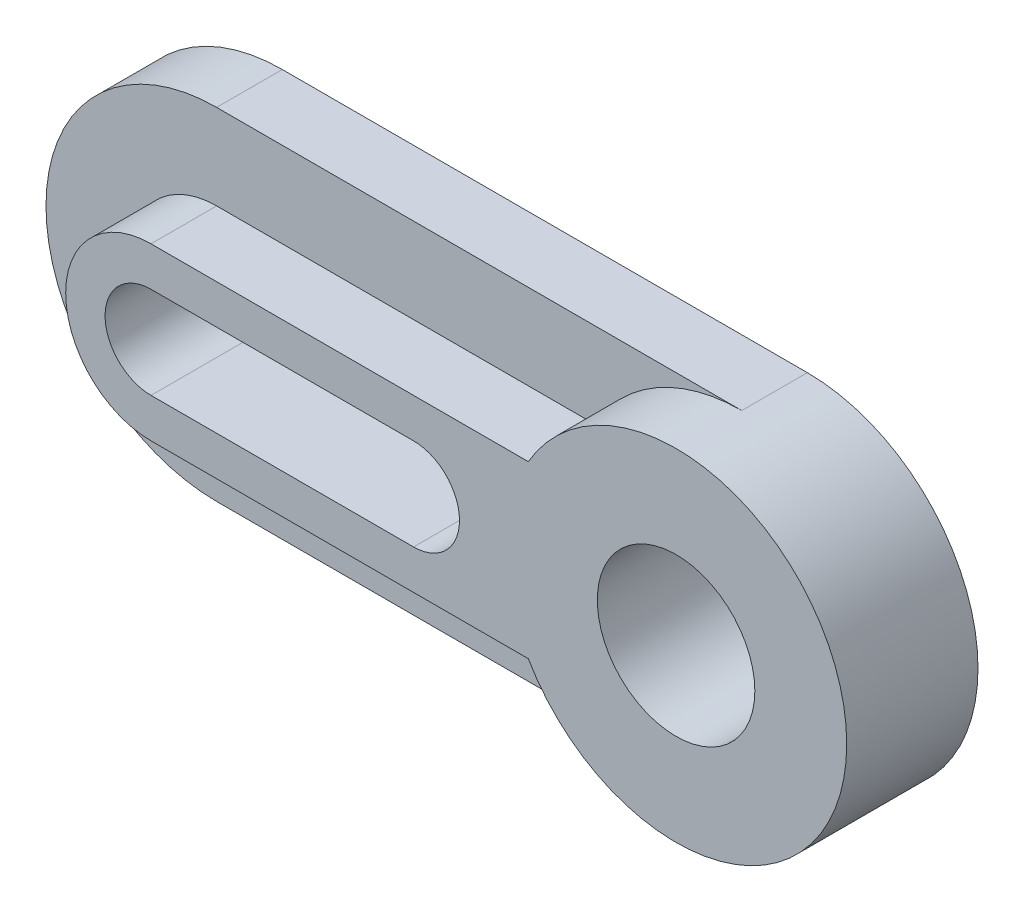
ISO-10303-21;
HEADER;
FILE_DESCRIPTION(('STEP AP214'),'2;1');
FILE_NAME('part.step','',(''),(''),'','','');
FILE_SCHEMA(('AUTOMOTIVE_DESIGN { 1 0 10303 214 1 1 1 1 }'));
ENDSEC;
DATA;
#1=APPLICATION_CONTEXT('core data for automotive mechanical design processes');
#2=APPLICATION_PROTOCOL_DEFINITION('international standard','automotive_design',2000,#1);
#3=PRODUCT_CONTEXT('',#1,'mechanical');
#4=PRODUCT('Part','Part','',(#3));
#5=PRODUCT_RELATED_PRODUCT_CATEGORY('part','',(#4));
#6=PRODUCT_DEFINITION_FORMATION('','',#4);
#7=PRODUCT_DEFINITION_CONTEXT('part definition',#1,'design');
#8=PRODUCT_DEFINITION('design','',#6,#7);
#9=PRODUCT_DEFINITION_SHAPE('','',#8);
#10=(LENGTH_UNIT() NAMED_UNIT(*) SI_UNIT(.MILLI.,.METRE.));
#11=(NAMED_UNIT(*) PLANE_ANGLE_UNIT() SI_UNIT($,.RADIAN.));
#12=(NAMED_UNIT(*) SI_UNIT($,.STERADIAN.) SOLID_ANGLE_UNIT());
#13=UNCERTAINTY_MEASURE_WITH_UNIT(LENGTH_MEASURE(1.E-05),#10,'distance_accuracy_value','');
#14=(GEOMETRIC_REPRESENTATION_CONTEXT(3) GLOBAL_UNCERTAINTY_ASSIGNED_CONTEXT((#13)) GLOBAL_UNIT_ASSIGNED_CONTEXT((#10,
#11,#12)) REPRESENTATION_CONTEXT('',''));
#15=CARTESIAN_POINT('',(0.,0.,0.));
#16=DIRECTION('',(0.,0.,1.));
#17=DIRECTION('',(1.,0.,0.));
#18=AXIS2_PLACEMENT_3D('',#15,#16,#17);
#19=CARTESIAN_POINT('',(0.,0.,10.));
#20=DIRECTION('',(0.,0.,-1.));
#21=DIRECTION('',(-1.,0.,0.));
#22=AXIS2_PLACEMENT_3D('',#19,#20,#21);
#23=CYLINDRICAL_SURFACE('',#22,26.);
#24=CARTESIAN_POINT('',(0.,0.,0.));
#25=DIRECTION('',(0.,0.,1.));
#26=DIRECTION('',(1.,0.,0.));
#27=AXIS2_PLACEMENT_3D('',#24,#25,#26);
#28=CIRCLE('',#27,26.);
#29=CARTESIAN_POINT('',(0.,26.,0.));
#30=VERTEX_POINT('',#29);
#31=CARTESIAN_POINT('',(0.,-26.,0.));
#32=VERTEX_POINT('',#31);
#33=EDGE_CURVE('E150',#30,#32,#28,.T.);
#34=ORIENTED_EDGE('',*,*,#33,.T.);
#35=DIRECTION('',(0.,0.,-1.));
#36=VECTOR('',#35,1.);
#37=CARTESIAN_POINT('',(0.,-26.,10.));
#38=LINE('',#37,#36);
#39=CARTESIAN_POINT('',(0.,-26.,10.));
#40=VERTEX_POINT('',#39);
#41=EDGE_CURVE('E45',#40,#32,#38,.T.);
#42=ORIENTED_EDGE('',*,*,#41,.F.);
#43=CARTESIAN_POINT('',(0.,0.,10.));
#44=DIRECTION('',(0.,0.,1.));
#45=DIRECTION('',(1.,0.,0.));
#46=AXIS2_PLACEMENT_3D('',#43,#44,#45);
#47=CIRCLE('',#46,26.);
#48=CARTESIAN_POINT('',(0.,26.,10.));
#49=VERTEX_POINT('',#48);
#50=EDGE_CURVE('E154',#49,#40,#47,.T.);
#51=ORIENTED_EDGE('',*,*,#50,.F.);
#52=DIRECTION('',(0.,0.,-1.));
#53=VECTOR('',#52,1.);
#54=CARTESIAN_POINT('',(0.,26.,10.));
#55=LINE('',#54,#53);
#56=EDGE_CURVE('E163',#49,#30,#55,.T.);
#57=ORIENTED_EDGE('',*,*,#56,.T.);
#58=EDGE_LOOP('',(#34,#42,#51,#57));
#59=FACE_BOUND('',#58,.T.);
#60=ADVANCED_FACE('F36',(#59),#23,.T.);
#61=CARTESIAN_POINT('',(0.,-26.,10.));
#62=DIRECTION('',(0.,1.,0.));
#63=DIRECTION('',(0.,0.,1.));
#64=AXIS2_PLACEMENT_3D('',#61,#62,#63);
#65=PLANE('',#64);
#66=DIRECTION('',(1.,0.,0.));
#67=VECTOR('',#66,1.);
#68=CARTESIAN_POINT('',(0.,-26.,0.));
#69=LINE('',#68,#67);
#70=CARTESIAN_POINT('',(80.,-26.,0.));
#71=VERTEX_POINT('',#70);
#72=EDGE_CURVE('E281',#32,#71,#69,.T.);
#73=ORIENTED_EDGE('',*,*,#72,.T.);
#74=DIRECTION('',(0.,0.,-1.));
#75=VECTOR('',#74,1.);
#76=CARTESIAN_POINT('',(80.,-26.,10.));
#77=LINE('',#76,#75);
#78=CARTESIAN_POINT('',(80.,-26.,10.));
#79=VERTEX_POINT('',#78);
#80=EDGE_CURVE('E162',#79,#71,#77,.T.);
#81=ORIENTED_EDGE('',*,*,#80,.F.);
#82=DIRECTION('',(1.,0.,0.));
#83=VECTOR('',#82,1.);
#84=CARTESIAN_POINT('',(0.,-26.,10.));
#85=LINE('',#84,#83);
#86=EDGE_CURVE('E168',#40,#79,#85,.T.);
#87=ORIENTED_EDGE('',*,*,#86,.F.);
#88=ORIENTED_EDGE('',*,*,#41,.T.);
#89=EDGE_LOOP('',(#73,#81,#87,#88));
#90=FACE_BOUND('',#89,.T.);
#91=ADVANCED_FACE('F267',(#90),#65,.F.);
#92=CARTESIAN_POINT('',(80.,0.,10.));
#93=DIRECTION('',(0.,0.,-1.));
#94=DIRECTION('',(-1.,0.,0.));
#95=AXIS2_PLACEMENT_3D('',#92,#93,#94);
#96=CYLINDRICAL_SURFACE('',#95,26.);
#97=CARTESIAN_POINT('',(80.,0.,0.));
#98=DIRECTION('',(0.,0.,1.));
#99=DIRECTION('',(1.,0.,0.));
#100=AXIS2_PLACEMENT_3D('',#97,#98,#99);
#101=CIRCLE('',#100,26.);
#102=CARTESIAN_POINT('',(80.,26.,0.));
#103=VERTEX_POINT('',#102);
#104=EDGE_CURVE('E282',#71,#103,#101,.T.);
#105=ORIENTED_EDGE('',*,*,#104,.T.);
#106=DIRECTION('',(0.,0.,-1.));
#107=VECTOR('',#106,1.);
#108=CARTESIAN_POINT('',(80.,26.,10.));
#109=LINE('',#108,#107);
#110=CARTESIAN_POINT('',(80.,26.,10.));
#111=VERTEX_POINT('',#110);
#112=EDGE_CURVE('E135',#111,#103,#109,.T.);
#113=ORIENTED_EDGE('',*,*,#112,.F.);
#114=CARTESIAN_POINT('',(80.,0.,10.));
#115=DIRECTION('',(0.,0.,1.));
#116=DIRECTION('',(1.,0.,0.));
#117=AXIS2_PLACEMENT_3D('',#114,#115,#116);
#118=CIRCLE('',#117,26.);
#119=CARTESIAN_POINT('',(57.4833395016046,13.,10.));
#120=VERTEX_POINT('',#119);
#121=EDGE_CURVE('E11',#111,#120,#118,.T.);
#122=ORIENTED_EDGE('',*,*,#121,.T.);
#123=DIRECTION('',(0.,0.,-1.));
#124=VECTOR('',#123,1.);
#125=CARTESIAN_POINT('',(57.4833395016046,13.,20.));
#126=LINE('',#125,#124);
#127=CARTESIAN_POINT('',(57.4833395016046,13.,20.));
#128=VERTEX_POINT('',#127);
#129=EDGE_CURVE('E132',#128,#120,#126,.T.);
#130=ORIENTED_EDGE('',*,*,#129,.F.);
#131=CARTESIAN_POINT('',(80.,0.,20.));
#132=DIRECTION('',(0.,0.,1.));
#133=DIRECTION('',(1.,0.,0.));
#134=AXIS2_PLACEMENT_3D('',#131,#132,#133);
#135=CIRCLE('',#134,26.);
#136=CARTESIAN_POINT('',(57.4833395016046,-13.,20.));
#137=VERTEX_POINT('',#136);
#138=EDGE_CURVE('E191',#137,#128,#135,.T.);
#139=ORIENTED_EDGE('',*,*,#138,.F.);
#140=DIRECTION('',(0.,0.,-1.));
#141=VECTOR('',#140,1.);
#142=CARTESIAN_POINT('',(57.4833395016046,-13.,20.));
#143=LINE('',#142,#141);
#144=CARTESIAN_POINT('',(57.4833395016046,-13.,10.));
#145=VERTEX_POINT('',#144);
#146=EDGE_CURVE('E140',#137,#145,#143,.T.);
#147=ORIENTED_EDGE('',*,*,#146,.T.);
#148=EDGE_CURVE('E78',#145,#79,#118,.T.);
#149=ORIENTED_EDGE('',*,*,#148,.T.);
#150=ORIENTED_EDGE('',*,*,#80,.T.);
#151=EDGE_LOOP('',(#105,#113,#122,#130,#139,#147,#149,#150));
#152=FACE_BOUND('',#151,.T.);
#153=ADVANCED_FACE('F129',(#152),#96,.T.);
#154=CARTESIAN_POINT('',(0.,26.,10.));
#155=DIRECTION('',(0.,-1.,0.));
#156=DIRECTION('',(0.,0.,-1.));
#157=AXIS2_PLACEMENT_3D('',#154,#155,#156);
#158=PLANE('',#157);
#159=DIRECTION('',(-1.,0.,0.));
#160=VECTOR('',#159,1.);
#161=CARTESIAN_POINT('',(0.,26.,0.));
#162=LINE('',#161,#160);
#163=EDGE_CURVE('E286',#103,#30,#162,.T.);
#164=ORIENTED_EDGE('',*,*,#163,.T.);
#165=ORIENTED_EDGE('',*,*,#56,.F.);
#166=DIRECTION('',(-1.,0.,0.));
#167=VECTOR('',#166,1.);
#168=CARTESIAN_POINT('',(0.,26.,10.));
#169=LINE('',#168,#167);
#170=EDGE_CURVE('E166',#111,#49,#169,.T.);
#171=ORIENTED_EDGE('',*,*,#170,.F.);
#172=ORIENTED_EDGE('',*,*,#112,.T.);
#173=EDGE_LOOP('',(#164,#165,#171,#172));
#174=FACE_BOUND('',#173,.T.);
#175=ADVANCED_FACE('F290',(#174),#158,.F.);
#176=CARTESIAN_POINT('',(0.,0.,10.));
#177=DIRECTION('',(0.,0.,1.));
#178=DIRECTION('',(1.,0.,0.));
#179=AXIS2_PLACEMENT_3D('',#176,#177,#178);
#180=PLANE('',#179);
#181=ORIENTED_EDGE('',*,*,#121,.F.);
#182=ORIENTED_EDGE('',*,*,#170,.T.);
#183=ORIENTED_EDGE('',*,*,#50,.T.);
#184=ORIENTED_EDGE('',*,*,#86,.T.);
#185=ORIENTED_EDGE('',*,*,#148,.F.);
#186=DIRECTION('',(1.,0.,0.));
#187=VECTOR('',#186,1.);
#188=CARTESIAN_POINT('',(0.,-13.,10.));
#189=LINE('',#188,#187);
#190=CARTESIAN_POINT('',(0.,-13.,10.));
#191=VERTEX_POINT('',#190);
#192=EDGE_CURVE('E153',#191,#145,#189,.T.);
#193=ORIENTED_EDGE('',*,*,#192,.F.);
#194=CARTESIAN_POINT('',(0.,0.,10.));
#195=DIRECTION('',(0.,0.,1.));
#196=DIRECTION('',(1.,0.,0.));
#197=AXIS2_PLACEMENT_3D('',#194,#195,#196);
#198=CIRCLE('',#197,13.);
#199=CARTESIAN_POINT('',(0.,13.,10.));
#200=VERTEX_POINT('',#199);
#201=EDGE_CURVE('E120',#200,#191,#198,.T.);
#202=ORIENTED_EDGE('',*,*,#201,.F.);
#203=DIRECTION('',(-1.,0.,0.));
#204=VECTOR('',#203,1.);
#205=CARTESIAN_POINT('',(0.,13.,10.));
#206=LINE('',#205,#204);
#207=EDGE_CURVE('E116',#120,#200,#206,.T.);
#208=ORIENTED_EDGE('',*,*,#207,.F.);
#209=EDGE_LOOP('',(#181,#182,#183,#184,#185,#193,#202,#208));
#210=FACE_BOUND('',#209,.T.);
#211=ADVANCED_FACE('F117',(#210),#180,.T.);
#212=CARTESIAN_POINT('',(0.,0.,0.));
#213=DIRECTION('',(0.,0.,1.));
#214=DIRECTION('',(1.,0.,0.));
#215=AXIS2_PLACEMENT_3D('',#212,#213,#214);
#216=PLANE('',#215);
#217=CARTESIAN_POINT('',(80.,0.,0.));
#218=DIRECTION('',(0.,0.,1.));
#219=DIRECTION('',(1.,0.,0.));
#220=AXIS2_PLACEMENT_3D('',#217,#218,#219);
#221=CIRCLE('',#220,12.);
#222=CARTESIAN_POINT('',(92.,0.,0.));
#223=VERTEX_POINT('',#222);
#224=EDGE_CURVE('E218',#223,#223,#221,.T.);
#225=ORIENTED_EDGE('',*,*,#224,.T.);
#226=EDGE_LOOP('',(#225));
#227=FACE_BOUND('',#226,.T.);
#228=DIRECTION('',(1.,0.,0.));
#229=VECTOR('',#228,1.);
#230=CARTESIAN_POINT('',(0.,7.,0.));
#231=LINE('',#230,#229);
#232=CARTESIAN_POINT('',(40.,7.,0.));
#233=VERTEX_POINT('',#232);
#234=CARTESIAN_POINT('',(0.,7.,0.));
#235=VERTEX_POINT('',#234);
#236=EDGE_CURVE('E181',#233,#235,#231,.F.);
#237=ORIENTED_EDGE('',*,*,#236,.T.);
#238=CARTESIAN_POINT('',(0.,0.,0.));
#239=DIRECTION('',(0.,0.,1.));
#240=DIRECTION('',(1.,0.,0.));
#241=AXIS2_PLACEMENT_3D('',#238,#239,#240);
#242=CIRCLE('',#241,7.);
#243=CARTESIAN_POINT('',(0.,-7.,0.));
#244=VERTEX_POINT('',#243);
#245=EDGE_CURVE('E39',#235,#244,#242,.T.);
#246=ORIENTED_EDGE('',*,*,#245,.T.);
#247=DIRECTION('',(1.,0.,0.));
#248=VECTOR('',#247,1.);
#249=CARTESIAN_POINT('',(0.,-7.,0.));
#250=LINE('',#249,#248);
#251=CARTESIAN_POINT('',(40.,-7.,0.));
#252=VERTEX_POINT('',#251);
#253=EDGE_CURVE('E178',#244,#252,#250,.T.);
#254=ORIENTED_EDGE('',*,*,#253,.T.);
#255=CARTESIAN_POINT('',(40.,0.,0.));
#256=DIRECTION('',(0.,0.,1.));
#257=DIRECTION('',(1.,0.,0.));
#258=AXIS2_PLACEMENT_3D('',#255,#256,#257);
#259=CIRCLE('',#258,7.);
#260=EDGE_CURVE('E54',#252,#233,#259,.T.);
#261=ORIENTED_EDGE('',*,*,#260,.T.);
#262=EDGE_LOOP('',(#237,#246,#254,#261));
#263=FACE_BOUND('',#262,.T.);
#264=ORIENTED_EDGE('',*,*,#33,.F.);
#265=ORIENTED_EDGE('',*,*,#163,.F.);
#266=ORIENTED_EDGE('',*,*,#104,.F.);
#267=ORIENTED_EDGE('',*,*,#72,.F.);
#268=EDGE_LOOP('',(#264,#265,#266,#267));
#269=FACE_BOUND('',#268,.T.);
#270=ADVANCED_FACE('F256',(#227,#263,#269),#216,.F.);
#271=CARTESIAN_POINT('',(0.,0.,20.));
#272=DIRECTION('',(0.,0.,-1.));
#273=DIRECTION('',(-1.,0.,0.));
#274=AXIS2_PLACEMENT_3D('',#271,#272,#273);
#275=CYLINDRICAL_SURFACE('',#274,13.);
#276=ORIENTED_EDGE('',*,*,#201,.T.);
#277=DIRECTION('',(0.,0.,-1.));
#278=VECTOR('',#277,1.);
#279=CARTESIAN_POINT('',(0.,-13.,20.));
#280=LINE('',#279,#278);
#281=CARTESIAN_POINT('',(0.,-13.,20.));
#282=VERTEX_POINT('',#281);
#283=EDGE_CURVE('E144',#282,#191,#280,.T.);
#284=ORIENTED_EDGE('',*,*,#283,.F.);
#285=CARTESIAN_POINT('',(0.,0.,20.));
#286=DIRECTION('',(0.,0.,1.));
#287=DIRECTION('',(1.,0.,0.));
#288=AXIS2_PLACEMENT_3D('',#285,#286,#287);
#289=CIRCLE('',#288,13.);
#290=CARTESIAN_POINT('',(0.,13.,20.));
#291=VERTEX_POINT('',#290);
#292=EDGE_CURVE('E125',#291,#282,#289,.T.);
#293=ORIENTED_EDGE('',*,*,#292,.F.);
#294=DIRECTION('',(0.,0.,-1.));
#295=VECTOR('',#294,1.);
#296=CARTESIAN_POINT('',(0.,13.,20.));
#297=LINE('',#296,#295);
#298=EDGE_CURVE('E141',#291,#200,#297,.T.);
#299=ORIENTED_EDGE('',*,*,#298,.T.);
#300=EDGE_LOOP('',(#276,#284,#293,#299));
#301=FACE_BOUND('',#300,.T.);
#302=ADVANCED_FACE('F240',(#301),#275,.T.);
#303=CARTESIAN_POINT('',(0.,-13.,20.));
#304=DIRECTION('',(0.,1.,0.));
#305=DIRECTION('',(0.,0.,1.));
#306=AXIS2_PLACEMENT_3D('',#303,#304,#305);
#307=PLANE('',#306);
#308=ORIENTED_EDGE('',*,*,#192,.T.);
#309=ORIENTED_EDGE('',*,*,#146,.F.);
#310=DIRECTION('',(1.,0.,0.));
#311=VECTOR('',#310,1.);
#312=CARTESIAN_POINT('',(0.,-13.,20.));
#313=LINE('',#312,#311);
#314=EDGE_CURVE('E194',#282,#137,#313,.T.);
#315=ORIENTED_EDGE('',*,*,#314,.F.);
#316=ORIENTED_EDGE('',*,*,#283,.T.);
#317=EDGE_LOOP('',(#308,#309,#315,#316));
#318=FACE_BOUND('',#317,.T.);
#319=ADVANCED_FACE('F242',(#318),#307,.F.);
#320=CARTESIAN_POINT('',(0.,13.,20.));
#321=DIRECTION('',(0.,-1.,0.));
#322=DIRECTION('',(0.,0.,-1.));
#323=AXIS2_PLACEMENT_3D('',#320,#321,#322);
#324=PLANE('',#323);
#325=ORIENTED_EDGE('',*,*,#207,.T.);
#326=ORIENTED_EDGE('',*,*,#298,.F.);
#327=DIRECTION('',(-1.,0.,0.));
#328=VECTOR('',#327,1.);
#329=CARTESIAN_POINT('',(0.,13.,20.));
#330=LINE('',#329,#328);
#331=EDGE_CURVE('E139',#128,#291,#330,.T.);
#332=ORIENTED_EDGE('',*,*,#331,.F.);
#333=ORIENTED_EDGE('',*,*,#129,.T.);
#334=EDGE_LOOP('',(#325,#326,#332,#333));
#335=FACE_BOUND('',#334,.T.);
#336=ADVANCED_FACE('F137',(#335),#324,.F.);
#337=CARTESIAN_POINT('',(0.,0.,20.));
#338=DIRECTION('',(0.,0.,1.));
#339=DIRECTION('',(1.,0.,0.));
#340=AXIS2_PLACEMENT_3D('',#337,#338,#339);
#341=PLANE('',#340);
#342=CARTESIAN_POINT('',(80.,0.,20.));
#343=DIRECTION('',(0.,0.,1.));
#344=DIRECTION('',(1.,0.,0.));
#345=AXIS2_PLACEMENT_3D('',#342,#343,#344);
#346=CIRCLE('',#345,12.);
#347=CARTESIAN_POINT('',(92.,0.,20.));
#348=VERTEX_POINT('',#347);
#349=EDGE_CURVE('E221',#348,#348,#346,.T.);
#350=ORIENTED_EDGE('',*,*,#349,.F.);
#351=EDGE_LOOP('',(#350));
#352=FACE_BOUND('',#351,.T.);
#353=CARTESIAN_POINT('',(0.,0.,20.));
#354=DIRECTION('',(0.,0.,1.));
#355=DIRECTION('',(1.,0.,0.));
#356=AXIS2_PLACEMENT_3D('',#353,#354,#355);
#357=CIRCLE('',#356,7.);
#358=CARTESIAN_POINT('',(0.,7.,20.));
#359=VERTEX_POINT('',#358);
#360=CARTESIAN_POINT('',(0.,-7.,20.));
#361=VERTEX_POINT('',#360);
#362=EDGE_CURVE('E216',#359,#361,#357,.T.);
#363=ORIENTED_EDGE('',*,*,#362,.F.);
#364=DIRECTION('',(-1.,0.,0.));
#365=VECTOR('',#364,1.);
#366=CARTESIAN_POINT('',(0.,7.,20.));
#367=LINE('',#366,#365);
#368=CARTESIAN_POINT('',(40.,7.,20.));
#369=VERTEX_POINT('',#368);
#370=EDGE_CURVE('E207',#369,#359,#367,.T.);
#371=ORIENTED_EDGE('',*,*,#370,.F.);
#372=CARTESIAN_POINT('',(40.,0.,20.));
#373=DIRECTION('',(0.,0.,1.));
#374=DIRECTION('',(1.,0.,0.));
#375=AXIS2_PLACEMENT_3D('',#372,#373,#374);
#376=CIRCLE('',#375,7.);
#377=CARTESIAN_POINT('',(40.,-7.,20.));
#378=VERTEX_POINT('',#377);
#379=EDGE_CURVE('E210',#378,#369,#376,.T.);
#380=ORIENTED_EDGE('',*,*,#379,.F.);
#381=DIRECTION('',(1.,0.,0.));
#382=VECTOR('',#381,1.);
#383=CARTESIAN_POINT('',(0.,-7.,20.));
#384=LINE('',#383,#382);
#385=EDGE_CURVE('E213',#361,#378,#384,.T.);
#386=ORIENTED_EDGE('',*,*,#385,.F.);
#387=EDGE_LOOP('',(#363,#371,#380,#386));
#388=FACE_BOUND('',#387,.T.);
#389=ORIENTED_EDGE('',*,*,#292,.T.);
#390=ORIENTED_EDGE('',*,*,#314,.T.);
#391=ORIENTED_EDGE('',*,*,#138,.T.);
#392=ORIENTED_EDGE('',*,*,#331,.T.);
#393=EDGE_LOOP('',(#389,#390,#391,#392));
#394=FACE_BOUND('',#393,.T.);
#395=ADVANCED_FACE('F228',(#352,#388,#394),#341,.T.);
#396=CARTESIAN_POINT('',(0.,0.,-2.50000000007189E-05));
#397=DIRECTION('',(0.,0.,1.));
#398=DIRECTION('',(1.,0.,0.));
#399=AXIS2_PLACEMENT_3D('',#396,#397,#398);
#400=CYLINDRICAL_SURFACE('',#399,7.);
#401=DIRECTION('',(0.,0.,1.));
#402=VECTOR('',#401,1.);
#403=CARTESIAN_POINT('',(0.,7.,-2.50000000007189E-05));
#404=LINE('',#403,#402);
#405=EDGE_CURVE('E69',#235,#359,#404,.T.);
#406=ORIENTED_EDGE('',*,*,#405,.T.);
#407=ORIENTED_EDGE('',*,*,#362,.T.);
#408=DIRECTION('',(0.,0.,1.));
#409=VECTOR('',#408,1.);
#410=CARTESIAN_POINT('',(0.,-7.,-2.50000000007189E-05));
#411=LINE('',#410,#409);
#412=EDGE_CURVE('E204',#244,#361,#411,.T.);
#413=ORIENTED_EDGE('',*,*,#412,.F.);
#414=ORIENTED_EDGE('',*,*,#245,.F.);
#415=EDGE_LOOP('',(#406,#407,#413,#414));
#416=FACE_BOUND('',#415,.T.);
#417=ADVANCED_FACE('F231',(#416),#400,.F.);
#418=CARTESIAN_POINT('',(0.,7.,-2.50000000007189E-05));
#419=DIRECTION('',(0.,1.,0.));
#420=DIRECTION('',(0.,0.,1.));
#421=AXIS2_PLACEMENT_3D('',#418,#419,#420);
#422=PLANE('',#421);
#423=DIRECTION('',(0.,0.,1.));
#424=VECTOR('',#423,1.);
#425=CARTESIAN_POINT('',(40.,7.,-2.50000000007189E-05));
#426=LINE('',#425,#424);
#427=EDGE_CURVE('E200',#233,#369,#426,.T.);
#428=ORIENTED_EDGE('',*,*,#427,.T.);
#429=ORIENTED_EDGE('',*,*,#370,.T.);
#430=ORIENTED_EDGE('',*,*,#405,.F.);
#431=ORIENTED_EDGE('',*,*,#236,.F.);
#432=EDGE_LOOP('',(#428,#429,#430,#431));
#433=FACE_BOUND('',#432,.T.);
#434=ADVANCED_FACE('F255',(#433),#422,.F.);
#435=CARTESIAN_POINT('',(40.,0.,-2.50000000007189E-05));
#436=DIRECTION('',(0.,0.,1.));
#437=DIRECTION('',(1.,0.,0.));
#438=AXIS2_PLACEMENT_3D('',#435,#436,#437);
#439=CYLINDRICAL_SURFACE('',#438,7.);
#440=DIRECTION('',(0.,0.,1.));
#441=VECTOR('',#440,1.);
#442=CARTESIAN_POINT('',(40.,-7.,-2.50000000007189E-05));
#443=LINE('',#442,#441);
#444=EDGE_CURVE('E203',#252,#378,#443,.T.);
#445=ORIENTED_EDGE('',*,*,#444,.T.);
#446=ORIENTED_EDGE('',*,*,#379,.T.);
#447=ORIENTED_EDGE('',*,*,#427,.F.);
#448=ORIENTED_EDGE('',*,*,#260,.F.);
#449=EDGE_LOOP('',(#445,#446,#447,#448));
#450=FACE_BOUND('',#449,.T.);
#451=ADVANCED_FACE('F249',(#450),#439,.F.);
#452=CARTESIAN_POINT('',(0.,-7.,-2.50000000007189E-05));
#453=DIRECTION('',(0.,-1.,0.));
#454=DIRECTION('',(0.,0.,-1.));
#455=AXIS2_PLACEMENT_3D('',#452,#453,#454);
#456=PLANE('',#455);
#457=ORIENTED_EDGE('',*,*,#412,.T.);
#458=ORIENTED_EDGE('',*,*,#385,.T.);
#459=ORIENTED_EDGE('',*,*,#444,.F.);
#460=ORIENTED_EDGE('',*,*,#253,.F.);
#461=EDGE_LOOP('',(#457,#458,#459,#460));
#462=FACE_BOUND('',#461,.T.);
#463=ADVANCED_FACE('F253',(#462),#456,.F.);
#464=CARTESIAN_POINT('',(80.,0.,-2.50000000007189E-05));
#465=DIRECTION('',(0.,0.,1.));
#466=DIRECTION('',(1.,0.,0.));
#467=AXIS2_PLACEMENT_3D('',#464,#465,#466);
#468=CYLINDRICAL_SURFACE('',#467,12.);
#469=ORIENTED_EDGE('',*,*,#349,.T.);
#470=EDGE_LOOP('',(#469));
#471=FACE_BOUND('',#470,.T.);
#472=ORIENTED_EDGE('',*,*,#224,.F.);
#473=EDGE_LOOP('',(#472));
#474=FACE_BOUND('',#473,.T.);
#475=ADVANCED_FACE('F225',(#471,#474),#468,.F.);
#476=CLOSED_SHELL('',(#60,#91,#153,#175,#211,#270,#302,#319,#336,#395,#417,#434,#451,#463,#475));
#477=MANIFOLD_SOLID_BREP('B2',#476);
#478=ADVANCED_BREP_SHAPE_REPRESENTATION('',(#18,#477),#14);
#479=SHAPE_DEFINITION_REPRESENTATION(#9,#478);
ENDSEC;
END-ISO-10303-21;
